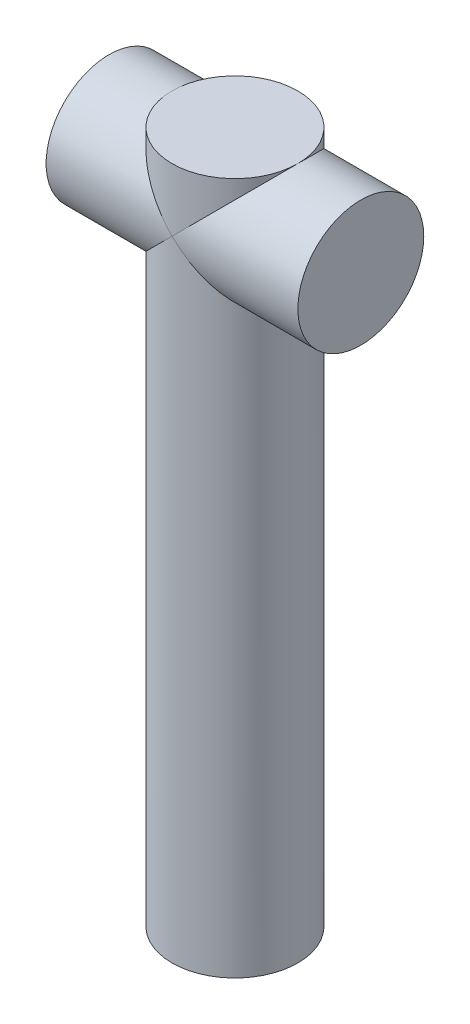
ISO-10303-21;
HEADER;
FILE_DESCRIPTION(('STEP AP214'),'2;1');
FILE_NAME('part.step','',(''),(''),'','','');
FILE_SCHEMA(('AUTOMOTIVE_DESIGN { 1 0 10303 214 1 1 1 1 }'));
ENDSEC;
DATA;
#1=APPLICATION_CONTEXT('core data for automotive mechanical design processes');
#2=APPLICATION_PROTOCOL_DEFINITION('international standard','automotive_design',2000,#1);
#3=PRODUCT_CONTEXT('',#1,'mechanical');
#4=PRODUCT('Part','Part','',(#3));
#5=PRODUCT_RELATED_PRODUCT_CATEGORY('part','',(#4));
#6=PRODUCT_DEFINITION_FORMATION('','',#4);
#7=PRODUCT_DEFINITION_CONTEXT('part definition',#1,'design');
#8=PRODUCT_DEFINITION('design','',#6,#7);
#9=PRODUCT_DEFINITION_SHAPE('','',#8);
#10=(LENGTH_UNIT() NAMED_UNIT(*) SI_UNIT(.MILLI.,.METRE.));
#11=(NAMED_UNIT(*) PLANE_ANGLE_UNIT() SI_UNIT($,.RADIAN.));
#12=(NAMED_UNIT(*) SI_UNIT($,.STERADIAN.) SOLID_ANGLE_UNIT());
#13=UNCERTAINTY_MEASURE_WITH_UNIT(LENGTH_MEASURE(1.E-05),#10,'distance_accuracy_value','');
#14=(GEOMETRIC_REPRESENTATION_CONTEXT(3) GLOBAL_UNCERTAINTY_ASSIGNED_CONTEXT((#13)) GLOBAL_UNIT_ASSIGNED_CONTEXT((#10,
#11,#12)) REPRESENTATION_CONTEXT('',''));
#15=CARTESIAN_POINT('',(0.,0.,0.));
#16=DIRECTION('',(0.,0.,1.));
#17=DIRECTION('',(1.,0.,0.));
#18=AXIS2_PLACEMENT_3D('',#15,#16,#17);
#19=CARTESIAN_POINT('',(0.,-165.,0.));
#20=DIRECTION('',(0.,1.,0.));
#21=DIRECTION('',(0.,0.,1.));
#22=AXIS2_PLACEMENT_3D('',#19,#20,#21);
#23=CYLINDRICAL_SURFACE('',#22,15.);
#24=CARTESIAN_POINT('',(0.,-15.,0.));
#25=DIRECTION('',(0.707106781186547,0.707106781186547,0.));
#26=DIRECTION('',(-0.707106781186547,0.707106781186547,0.));
#27=AXIS2_PLACEMENT_3D('',#24,#25,#26);
#28=ELLIPSE('',#27,21.2132034355964,15.);
#29=CARTESIAN_POINT('',(0.,-15.,15.));
#30=VERTEX_POINT('',#29);
#31=CARTESIAN_POINT('',(0.,-15.,-15.));
#32=VERTEX_POINT('',#31);
#33=EDGE_CURVE('E93',#30,#32,#28,.T.);
#34=ORIENTED_EDGE('',*,*,#33,.F.);
#35=CARTESIAN_POINT('',(0.,-15.,0.));
#36=DIRECTION('',(-0.707106781186547,0.707106781186547,0.));
#37=DIRECTION('',(0.707106781186547,0.707106781186547,0.));
#38=AXIS2_PLACEMENT_3D('',#35,#36,#37);
#39=ELLIPSE('',#38,21.2132034355964,15.);
#40=EDGE_CURVE('E65',#32,#30,#39,.T.);
#41=ORIENTED_EDGE('',*,*,#40,.F.);
#42=EDGE_LOOP('',(#34,#41));
#43=FACE_BOUND('',#42,.T.);
#44=CARTESIAN_POINT('',(0.,-165.,0.));
#45=DIRECTION('',(0.,1.,0.));
#46=DIRECTION('',(0.,0.,1.));
#47=AXIS2_PLACEMENT_3D('',#44,#45,#46);
#48=CIRCLE('',#47,15.);
#49=CARTESIAN_POINT('',(0.,-165.,15.));
#50=VERTEX_POINT('',#49);
#51=EDGE_CURVE('E11',#50,#50,#48,.T.);
#52=ORIENTED_EDGE('',*,*,#51,.T.);
#53=EDGE_LOOP('',(#52));
#54=FACE_BOUND('',#53,.T.);
#55=ADVANCED_FACE('F43',(#43,#54),#23,.T.);
#56=CARTESIAN_POINT('',(0.,-165.,0.));
#57=DIRECTION('',(0.,1.,0.));
#58=DIRECTION('',(0.,0.,1.));
#59=AXIS2_PLACEMENT_3D('',#56,#57,#58);
#60=PLANE('',#59);
#61=ORIENTED_EDGE('',*,*,#51,.F.);
#62=EDGE_LOOP('',(#61));
#63=FACE_BOUND('',#62,.T.);
#64=ADVANCED_FACE('F126',(#63),#60,.F.);
#65=CARTESIAN_POINT('',(30.,-15.,0.));
#66=DIRECTION('',(1.,0.,0.));
#67=DIRECTION('',(0.,0.,-1.));
#68=AXIS2_PLACEMENT_3D('',#65,#66,#67);
#69=PLANE('',#68);
#70=CARTESIAN_POINT('',(30.,-15.,0.));
#71=DIRECTION('',(1.,0.,0.));
#72=DIRECTION('',(0.,0.,-1.));
#73=AXIS2_PLACEMENT_3D('',#70,#71,#72);
#74=CIRCLE('',#73,15.);
#75=CARTESIAN_POINT('',(30.,-15.,-15.));
#76=VERTEX_POINT('',#75);
#77=EDGE_CURVE('E114',#76,#76,#74,.T.);
#78=ORIENTED_EDGE('',*,*,#77,.T.);
#79=EDGE_LOOP('',(#78));
#80=FACE_BOUND('',#79,.T.);
#81=ADVANCED_FACE('F119',(#80),#69,.T.);
#82=CARTESIAN_POINT('',(-30.,-15.,0.));
#83=DIRECTION('',(1.,0.,0.));
#84=DIRECTION('',(0.,0.,-1.));
#85=AXIS2_PLACEMENT_3D('',#82,#83,#84);
#86=CYLINDRICAL_SURFACE('',#85,15.);
#87=ORIENTED_EDGE('',*,*,#77,.F.);
#88=EDGE_LOOP('',(#87));
#89=FACE_BOUND('',#88,.T.);
#90=ORIENTED_EDGE('',*,*,#33,.T.);
#91=CARTESIAN_POINT('',(0.,-15.,0.));
#92=DIRECTION('',(-0.707106781186547,0.707106781186547,0.));
#93=DIRECTION('',(0.707106781186547,0.707106781186547,0.));
#94=AXIS2_PLACEMENT_3D('',#91,#92,#93);
#95=ELLIPSE('',#94,21.2132034355964,15.);
#96=CARTESIAN_POINT('',(15.,0.,0.));
#97=VERTEX_POINT('',#96);
#98=EDGE_CURVE('E82',#32,#97,#95,.F.);
#99=ORIENTED_EDGE('',*,*,#98,.T.);
#100=EDGE_CURVE('E58',#97,#30,#95,.F.);
#101=ORIENTED_EDGE('',*,*,#100,.T.);
#102=EDGE_LOOP('',(#90,#99,#101));
#103=FACE_BOUND('',#102,.T.);
#104=ADVANCED_FACE('F92',(#89,#103),#86,.T.);
#105=CARTESIAN_POINT('',(0.,0.,0.));
#106=DIRECTION('',(0.,1.,0.));
#107=DIRECTION('',(0.,0.,1.));
#108=AXIS2_PLACEMENT_3D('',#105,#106,#107);
#109=PLANE('',#108);
#110=CARTESIAN_POINT('',(0.,0.,0.));
#111=DIRECTION('',(0.,1.,0.));
#112=DIRECTION('',(0.,0.,1.));
#113=AXIS2_PLACEMENT_3D('',#110,#111,#112);
#114=CIRCLE('',#113,15.);
#115=CARTESIAN_POINT('',(-15.,0.,0.));
#116=VERTEX_POINT('',#115);
#117=EDGE_CURVE('E75',#116,#97,#114,.T.);
#118=ORIENTED_EDGE('',*,*,#117,.T.);
#119=EDGE_CURVE('E46',#97,#116,#114,.T.);
#120=ORIENTED_EDGE('',*,*,#119,.T.);
#121=EDGE_LOOP('',(#118,#120));
#122=FACE_BOUND('',#121,.T.);
#123=ADVANCED_FACE('F85',(#122),#109,.T.);
#124=CARTESIAN_POINT('',(0.,-15.,0.));
#125=DIRECTION('',(0.707106781186547,0.707106781186547,0.));
#126=DIRECTION('',(-0.707106781186547,0.707106781186547,0.));
#127=AXIS2_PLACEMENT_3D('',#124,#125,#126);
#128=ELLIPSE('',#127,21.2132034355964,15.);
#129=EDGE_CURVE('E78',#30,#116,#128,.F.);
#130=ORIENTED_EDGE('',*,*,#129,.F.);
#131=ORIENTED_EDGE('',*,*,#100,.F.);
#132=ORIENTED_EDGE('',*,*,#117,.F.);
#133=EDGE_LOOP('',(#130,#131,#132));
#134=FACE_BOUND('',#133,.T.);
#135=ADVANCED_FACE('F74',(#134),#23,.T.);
#136=EDGE_CURVE('E90',#116,#32,#128,.F.);
#137=ORIENTED_EDGE('',*,*,#136,.F.);
#138=ORIENTED_EDGE('',*,*,#119,.F.);
#139=ORIENTED_EDGE('',*,*,#98,.F.);
#140=EDGE_LOOP('',(#137,#138,#139));
#141=FACE_BOUND('',#140,.T.);
#142=ADVANCED_FACE('F88',(#141),#23,.T.);
#143=ORIENTED_EDGE('',*,*,#40,.T.);
#144=ORIENTED_EDGE('',*,*,#129,.T.);
#145=ORIENTED_EDGE('',*,*,#136,.T.);
#146=EDGE_LOOP('',(#143,#144,#145));
#147=FACE_BOUND('',#146,.T.);
#148=CARTESIAN_POINT('',(-30.,-15.,0.));
#149=DIRECTION('',(1.,0.,0.));
#150=DIRECTION('',(0.,0.,-1.));
#151=AXIS2_PLACEMENT_3D('',#148,#149,#150);
#152=CIRCLE('',#151,15.);
#153=CARTESIAN_POINT('',(-30.,-15.,-15.));
#154=VERTEX_POINT('',#153);
#155=EDGE_CURVE('E80',#154,#154,#152,.T.);
#156=ORIENTED_EDGE('',*,*,#155,.T.);
#157=EDGE_LOOP('',(#156));
#158=FACE_BOUND('',#157,.T.);
#159=ADVANCED_FACE('F105',(#147,#158),#86,.T.);
#160=CARTESIAN_POINT('',(-30.,-15.,0.));
#161=DIRECTION('',(1.,0.,0.));
#162=DIRECTION('',(0.,0.,-1.));
#163=AXIS2_PLACEMENT_3D('',#160,#161,#162);
#164=PLANE('',#163);
#165=ORIENTED_EDGE('',*,*,#155,.F.);
#166=EDGE_LOOP('',(#165));
#167=FACE_BOUND('',#166,.T.);
#168=ADVANCED_FACE('F108',(#167),#164,.F.);
#169=CLOSED_SHELL('',(#55,#64,#81,#104,#123,#135,#142,#159,#168));
#170=MANIFOLD_SOLID_BREP('B2',#169);
#171=ADVANCED_BREP_SHAPE_REPRESENTATION('',(#18,#170),#14);
#172=SHAPE_DEFINITION_REPRESENTATION(#9,#171);
ENDSEC;
END-ISO-10303-21;
